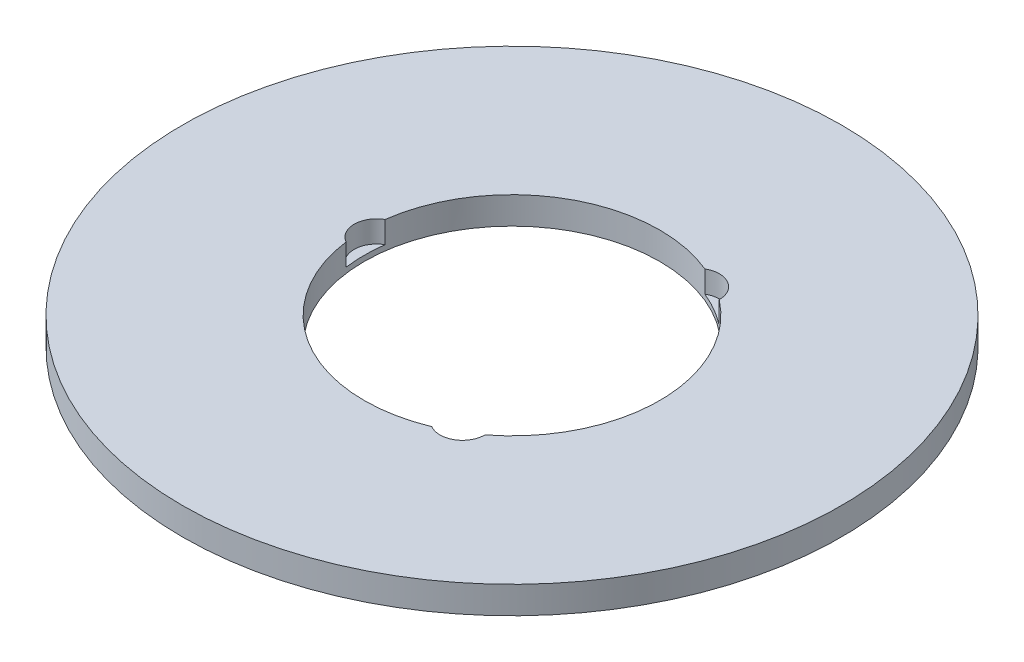
ISO-10303-21;
HEADER;
FILE_DESCRIPTION(('STEP AP214'),'2;1');
FILE_NAME('part.step','',(''),(''),'','','');
FILE_SCHEMA(('AUTOMOTIVE_DESIGN { 1 0 10303 214 1 1 1 1 }'));
ENDSEC;
DATA;
#1=APPLICATION_CONTEXT('core data for automotive mechanical design processes');
#2=APPLICATION_PROTOCOL_DEFINITION('international standard','automotive_design',2000,#1);
#3=PRODUCT_CONTEXT('',#1,'mechanical');
#4=PRODUCT('Part','Part','',(#3));
#5=PRODUCT_RELATED_PRODUCT_CATEGORY('part','',(#4));
#6=PRODUCT_DEFINITION_FORMATION('','',#4);
#7=PRODUCT_DEFINITION_CONTEXT('part definition',#1,'design');
#8=PRODUCT_DEFINITION('design','',#6,#7);
#9=PRODUCT_DEFINITION_SHAPE('','',#8);
#10=(LENGTH_UNIT() NAMED_UNIT(*) SI_UNIT(.MILLI.,.METRE.));
#11=(NAMED_UNIT(*) PLANE_ANGLE_UNIT() SI_UNIT($,.RADIAN.));
#12=(NAMED_UNIT(*) SI_UNIT($,.STERADIAN.) SOLID_ANGLE_UNIT());
#13=UNCERTAINTY_MEASURE_WITH_UNIT(LENGTH_MEASURE(1.E-05),#10,'distance_accuracy_value','');
#14=(GEOMETRIC_REPRESENTATION_CONTEXT(3) GLOBAL_UNCERTAINTY_ASSIGNED_CONTEXT((#13)) GLOBAL_UNIT_ASSIGNED_CONTEXT((#10,
#11,#12)) REPRESENTATION_CONTEXT('',''));
#15=CARTESIAN_POINT('',(0.,0.,0.));
#16=DIRECTION('',(0.,0.,1.));
#17=DIRECTION('',(1.,0.,0.));
#18=AXIS2_PLACEMENT_3D('',#15,#16,#17);
#19=CARTESIAN_POINT('',(0.,6.,0.));
#20=DIRECTION('',(0.,-1.,0.));
#21=DIRECTION('',(0.,0.,-1.));
#22=AXIS2_PLACEMENT_3D('',#19,#20,#21);
#23=CYLINDRICAL_SURFACE('',#22,72.5);
#24=CARTESIAN_POINT('',(0.,6.,0.));
#25=DIRECTION('',(0.,1.,0.));
#26=DIRECTION('',(0.,0.,1.));
#27=AXIS2_PLACEMENT_3D('',#24,#25,#26);
#28=CIRCLE('',#27,72.5);
#29=CARTESIAN_POINT('',(0.,6.,72.5));
#30=VERTEX_POINT('',#29);
#31=EDGE_CURVE('E130',#30,#30,#28,.T.);
#32=ORIENTED_EDGE('',*,*,#31,.F.);
#33=EDGE_LOOP('',(#32));
#34=FACE_BOUND('',#33,.T.);
#35=CARTESIAN_POINT('',(0.,0.,0.));
#36=DIRECTION('',(0.,1.,0.));
#37=DIRECTION('',(0.,0.,1.));
#38=AXIS2_PLACEMENT_3D('',#35,#36,#37);
#39=CIRCLE('',#38,72.5);
#40=CARTESIAN_POINT('',(0.,0.,72.5));
#41=VERTEX_POINT('',#40);
#42=EDGE_CURVE('E117',#41,#41,#39,.T.);
#43=ORIENTED_EDGE('',*,*,#42,.T.);
#44=EDGE_LOOP('',(#43));
#45=FACE_BOUND('',#44,.T.);
#46=ADVANCED_FACE('F39',(#34,#45),#23,.T.);
#47=CARTESIAN_POINT('',(0.,6.,0.));
#48=DIRECTION('',(0.,1.,0.));
#49=DIRECTION('',(0.,0.,1.));
#50=AXIS2_PLACEMENT_3D('',#47,#48,#49);
#51=PLANE('',#50);
#52=CARTESIAN_POINT('',(14.897619886915,6.,25.803434555985));
#53=DIRECTION('',(0.,1.,0.));
#54=DIRECTION('',(0.866025403784436,0.,-0.500000000000004));
#55=AXIS2_PLACEMENT_3D('',#52,#53,#54);
#56=CIRCLE('',#55,4.92004012785687);
#57=CARTESIAN_POINT('',(12.399089554762,6.,30.0418471171963));
#58=VERTEX_POINT('',#57);
#59=CARTESIAN_POINT('',(19.8174580027195,6.,25.7588500968201));
#60=VERTEX_POINT('',#59);
#61=EDGE_CURVE('E148',#58,#60,#56,.T.);
#62=ORIENTED_EDGE('',*,*,#61,.F.);
#63=CARTESIAN_POINT('',(0.,6.,0.));
#64=DIRECTION('',(0.,1.,0.));
#65=DIRECTION('',(0.,0.,1.));
#66=AXIS2_PLACEMENT_3D('',#63,#64,#65);
#67=CIRCLE('',#66,32.5);
#68=CARTESIAN_POINT('',(-32.2165475574812,6.,4.28299702037613));
#69=VERTEX_POINT('',#68);
#70=EDGE_CURVE('E113',#69,#58,#67,.T.);
#71=ORIENTED_EDGE('',*,*,#70,.F.);
#72=CARTESIAN_POINT('',(-29.7952397738298,6.,0.));
#73=DIRECTION('',(0.,1.,0.));
#74=DIRECTION('',(0.,0.,1.));
#75=AXIS2_PLACEMENT_3D('',#72,#73,#74);
#76=CIRCLE('',#75,4.92004012785687);
#77=CARTESIAN_POINT('',(-32.2165475574812,6.,-4.28299702037613));
#78=VERTEX_POINT('',#77);
#79=EDGE_CURVE('E125',#78,#69,#76,.T.);
#80=ORIENTED_EDGE('',*,*,#79,.F.);
#81=CARTESIAN_POINT('',(12.3990895547615,6.,-30.0418471171964));
#82=VERTEX_POINT('',#81);
#83=EDGE_CURVE('E107',#82,#78,#67,.T.);
#84=ORIENTED_EDGE('',*,*,#83,.F.);
#85=CARTESIAN_POINT('',(14.8976198869147,6.,-25.8034345559852));
#86=DIRECTION('',(0.,1.,0.));
#87=DIRECTION('',(-0.866025403784443,0.,-0.499999999999992));
#88=AXIS2_PLACEMENT_3D('',#85,#86,#87);
#89=CIRCLE('',#88,4.92004012785687);
#90=CARTESIAN_POINT('',(19.8174580027192,6.,-25.7588500968204));
#91=VERTEX_POINT('',#90);
#92=EDGE_CURVE('E95',#91,#82,#89,.T.);
#93=ORIENTED_EDGE('',*,*,#92,.F.);
#94=EDGE_CURVE('E106',#60,#91,#67,.T.);
#95=ORIENTED_EDGE('',*,*,#94,.F.);
#96=EDGE_LOOP('',(#62,#71,#80,#84,#93,#95));
#97=FACE_BOUND('',#96,.T.);
#98=ORIENTED_EDGE('',*,*,#31,.T.);
#99=EDGE_LOOP('',(#98));
#100=FACE_BOUND('',#99,.T.);
#101=ADVANCED_FACE('F102',(#97,#100),#51,.T.);
#102=CARTESIAN_POINT('',(0.,0.,0.));
#103=DIRECTION('',(0.,1.,0.));
#104=DIRECTION('',(0.,0.,1.));
#105=AXIS2_PLACEMENT_3D('',#102,#103,#104);
#106=PLANE('',#105);
#107=CARTESIAN_POINT('',(0.,0.,0.));
#108=DIRECTION('',(0.,1.,0.));
#109=DIRECTION('',(0.,0.,1.));
#110=AXIS2_PLACEMENT_3D('',#107,#108,#109);
#111=CIRCLE('',#110,32.5);
#112=CARTESIAN_POINT('',(0.,0.,32.5));
#113=VERTEX_POINT('',#112);
#114=EDGE_CURVE('E118',#113,#113,#111,.T.);
#115=ORIENTED_EDGE('',*,*,#114,.T.);
#116=EDGE_LOOP('',(#115));
#117=FACE_BOUND('',#116,.T.);
#118=ORIENTED_EDGE('',*,*,#42,.F.);
#119=EDGE_LOOP('',(#118));
#120=FACE_BOUND('',#119,.T.);
#121=ADVANCED_FACE('F161',(#117,#120),#106,.F.);
#122=CARTESIAN_POINT('',(0.,6.,0.));
#123=DIRECTION('',(0.,-1.,0.));
#124=DIRECTION('',(0.,0.,-1.));
#125=AXIS2_PLACEMENT_3D('',#122,#123,#124);
#126=CYLINDRICAL_SURFACE('',#125,32.5);
#127=DIRECTION('',(0.,1.,0.));
#128=VECTOR('',#127,1.);
#129=CARTESIAN_POINT('',(12.399089554762,3.59776294319901,30.0418471171963));
#130=LINE('',#129,#128);
#131=CARTESIAN_POINT('',(12.399089554762,1.19552588639802,30.0418471171963));
#132=VERTEX_POINT('',#131);
#133=EDGE_CURVE('E11',#132,#58,#130,.T.);
#134=ORIENTED_EDGE('',*,*,#133,.F.);
#135=CARTESIAN_POINT('',(0.,1.19552588639802,0.));
#136=DIRECTION('',(0.,1.,0.));
#137=DIRECTION('',(0.,0.,1.));
#138=AXIS2_PLACEMENT_3D('',#135,#136,#137);
#139=CIRCLE('',#138,32.5);
#140=CARTESIAN_POINT('',(19.8174580027195,1.19552588639802,25.7588500968201));
#141=VERTEX_POINT('',#140);
#142=EDGE_CURVE('E100',#132,#141,#139,.T.);
#143=ORIENTED_EDGE('',*,*,#142,.T.);
#144=DIRECTION('',(0.,1.,0.));
#145=VECTOR('',#144,1.);
#146=CARTESIAN_POINT('',(19.8174580027195,3.59776294319901,25.7588500968201));
#147=LINE('',#146,#145);
#148=EDGE_CURVE('E46',#60,#141,#147,.F.);
#149=ORIENTED_EDGE('',*,*,#148,.F.);
#150=ORIENTED_EDGE('',*,*,#94,.T.);
#151=DIRECTION('',(0.,1.,0.));
#152=VECTOR('',#151,1.);
#153=CARTESIAN_POINT('',(19.8174580027192,3.59776294319901,-25.7588500968204));
#154=LINE('',#153,#152);
#155=CARTESIAN_POINT('',(19.8174580027192,1.19552588639802,-25.7588500968204));
#156=VERTEX_POINT('',#155);
#157=EDGE_CURVE('E90',#156,#91,#154,.T.);
#158=ORIENTED_EDGE('',*,*,#157,.F.);
#159=CARTESIAN_POINT('',(0.,1.19552588639802,0.));
#160=DIRECTION('',(0.,1.,0.));
#161=DIRECTION('',(0.,0.,1.));
#162=AXIS2_PLACEMENT_3D('',#159,#160,#161);
#163=CIRCLE('',#162,32.5);
#164=CARTESIAN_POINT('',(12.3990895547615,1.19552588639802,-30.0418471171964));
#165=VERTEX_POINT('',#164);
#166=EDGE_CURVE('E143',#156,#165,#163,.T.);
#167=ORIENTED_EDGE('',*,*,#166,.T.);
#168=DIRECTION('',(0.,1.,0.));
#169=VECTOR('',#168,1.);
#170=CARTESIAN_POINT('',(12.3990895547616,3.59776294319901,-30.0418471171964));
#171=LINE('',#170,#169);
#172=EDGE_CURVE('E98',#82,#165,#171,.F.);
#173=ORIENTED_EDGE('',*,*,#172,.F.);
#174=ORIENTED_EDGE('',*,*,#83,.T.);
#175=DIRECTION('',(0.,1.,0.));
#176=VECTOR('',#175,1.);
#177=CARTESIAN_POINT('',(-32.2165475574812,3.59776294319901,-4.28299702037612));
#178=LINE('',#177,#176);
#179=CARTESIAN_POINT('',(-32.2165475574812,1.19552588639802,-4.28299702037613));
#180=VERTEX_POINT('',#179);
#181=EDGE_CURVE('E137',#180,#78,#178,.T.);
#182=ORIENTED_EDGE('',*,*,#181,.F.);
#183=CARTESIAN_POINT('',(0.,1.19552588639802,0.));
#184=DIRECTION('',(0.,1.,0.));
#185=DIRECTION('',(0.,0.,1.));
#186=AXIS2_PLACEMENT_3D('',#183,#184,#185);
#187=CIRCLE('',#186,32.5);
#188=CARTESIAN_POINT('',(-32.2165475574812,1.19552588639802,4.28299702037613));
#189=VERTEX_POINT('',#188);
#190=EDGE_CURVE('E128',#180,#189,#187,.T.);
#191=ORIENTED_EDGE('',*,*,#190,.T.);
#192=DIRECTION('',(0.,1.,0.));
#193=VECTOR('',#192,1.);
#194=CARTESIAN_POINT('',(-32.2165475574812,3.59776294319901,4.28299702037612));
#195=LINE('',#194,#193);
#196=EDGE_CURVE('E134',#69,#189,#195,.F.);
#197=ORIENTED_EDGE('',*,*,#196,.F.);
#198=ORIENTED_EDGE('',*,*,#70,.T.);
#199=EDGE_LOOP('',(#134,#143,#149,#150,#158,#167,#173,#174,#182,#191,#197,#198));
#200=FACE_BOUND('',#199,.T.);
#201=ORIENTED_EDGE('',*,*,#114,.F.);
#202=EDGE_LOOP('',(#201));
#203=FACE_BOUND('',#202,.T.);
#204=ADVANCED_FACE('F115',(#200,#203),#126,.F.);
#205=CARTESIAN_POINT('',(-29.7952397738298,1.19552588639802,0.));
#206=DIRECTION('',(0.,1.,0.));
#207=DIRECTION('',(0.,0.,1.));
#208=AXIS2_PLACEMENT_3D('',#205,#206,#207);
#209=CYLINDRICAL_SURFACE('',#208,4.92004012785687);
#210=ORIENTED_EDGE('',*,*,#181,.T.);
#211=ORIENTED_EDGE('',*,*,#79,.T.);
#212=ORIENTED_EDGE('',*,*,#196,.T.);
#213=CARTESIAN_POINT('',(-29.7952397738298,1.19552588639802,0.));
#214=DIRECTION('',(0.,1.,0.));
#215=DIRECTION('',(0.,0.,1.));
#216=AXIS2_PLACEMENT_3D('',#213,#214,#215);
#217=CIRCLE('',#216,4.92004012785687);
#218=EDGE_CURVE('E127',#180,#189,#217,.T.);
#219=ORIENTED_EDGE('',*,*,#218,.F.);
#220=EDGE_LOOP('',(#210,#211,#212,#219));
#221=FACE_BOUND('',#220,.T.);
#222=ADVANCED_FACE('F175',(#221),#209,.F.);
#223=CARTESIAN_POINT('',(-29.7952397738298,1.19552588639802,0.));
#224=DIRECTION('',(0.,1.,0.));
#225=DIRECTION('',(0.,0.,1.));
#226=AXIS2_PLACEMENT_3D('',#223,#224,#225);
#227=PLANE('',#226);
#228=ORIENTED_EDGE('',*,*,#218,.T.);
#229=ORIENTED_EDGE('',*,*,#190,.F.);
#230=EDGE_LOOP('',(#228,#229));
#231=FACE_BOUND('',#230,.T.);
#232=ADVANCED_FACE('F176',(#231),#227,.T.);
#233=CARTESIAN_POINT('',(14.8976198869147,1.19552588639802,-25.8034345559852));
#234=DIRECTION('',(0.,1.,0.));
#235=DIRECTION('',(0.,0.,1.));
#236=AXIS2_PLACEMENT_3D('',#233,#234,#235);
#237=CYLINDRICAL_SURFACE('',#236,4.92004012785687);
#238=ORIENTED_EDGE('',*,*,#157,.T.);
#239=ORIENTED_EDGE('',*,*,#92,.T.);
#240=ORIENTED_EDGE('',*,*,#172,.T.);
#241=CARTESIAN_POINT('',(14.8976198869147,1.19552588639802,-25.8034345559852));
#242=DIRECTION('',(0.,1.,0.));
#243=DIRECTION('',(-0.866025403784443,0.,-0.499999999999992));
#244=AXIS2_PLACEMENT_3D('',#241,#242,#243);
#245=CIRCLE('',#244,4.92004012785687);
#246=EDGE_CURVE('E56',#156,#165,#245,.T.);
#247=ORIENTED_EDGE('',*,*,#246,.F.);
#248=EDGE_LOOP('',(#238,#239,#240,#247));
#249=FACE_BOUND('',#248,.T.);
#250=ADVANCED_FACE('F93',(#249),#237,.F.);
#251=CARTESIAN_POINT('',(14.8976198869147,1.19552588639802,-25.8034345559852));
#252=DIRECTION('',(0.,1.,0.));
#253=DIRECTION('',(-0.866025403784443,0.,-0.499999999999992));
#254=AXIS2_PLACEMENT_3D('',#251,#252,#253);
#255=PLANE('',#254);
#256=ORIENTED_EDGE('',*,*,#246,.T.);
#257=ORIENTED_EDGE('',*,*,#166,.F.);
#258=EDGE_LOOP('',(#256,#257));
#259=FACE_BOUND('',#258,.T.);
#260=ADVANCED_FACE('F153',(#259),#255,.T.);
#261=CARTESIAN_POINT('',(14.897619886915,1.19552588639802,25.803434555985));
#262=DIRECTION('',(0.,1.,0.));
#263=DIRECTION('',(0.,0.,1.));
#264=AXIS2_PLACEMENT_3D('',#261,#262,#263);
#265=CYLINDRICAL_SURFACE('',#264,4.92004012785687);
#266=ORIENTED_EDGE('',*,*,#133,.T.);
#267=ORIENTED_EDGE('',*,*,#61,.T.);
#268=ORIENTED_EDGE('',*,*,#148,.T.);
#269=CARTESIAN_POINT('',(14.897619886915,1.19552588639802,25.803434555985));
#270=DIRECTION('',(0.,1.,0.));
#271=DIRECTION('',(0.866025403784436,0.,-0.500000000000004));
#272=AXIS2_PLACEMENT_3D('',#269,#270,#271);
#273=CIRCLE('',#272,4.92004012785687);
#274=EDGE_CURVE('E55',#132,#141,#273,.T.);
#275=ORIENTED_EDGE('',*,*,#274,.F.);
#276=EDGE_LOOP('',(#266,#267,#268,#275));
#277=FACE_BOUND('',#276,.T.);
#278=ADVANCED_FACE('F144',(#277),#265,.F.);
#279=CARTESIAN_POINT('',(14.897619886915,1.19552588639802,25.803434555985));
#280=DIRECTION('',(0.,1.,0.));
#281=DIRECTION('',(0.866025403784436,0.,-0.500000000000004));
#282=AXIS2_PLACEMENT_3D('',#279,#280,#281);
#283=PLANE('',#282);
#284=ORIENTED_EDGE('',*,*,#274,.T.);
#285=ORIENTED_EDGE('',*,*,#142,.F.);
#286=EDGE_LOOP('',(#284,#285));
#287=FACE_BOUND('',#286,.T.);
#288=ADVANCED_FACE('F150',(#287),#283,.T.);
#289=CLOSED_SHELL('',(#46,#101,#121,#204,#222,#232,#250,#260,#278,#288));
#290=MANIFOLD_SOLID_BREP('B2',#289);
#291=ADVANCED_BREP_SHAPE_REPRESENTATION('',(#18,#290),#14);
#292=SHAPE_DEFINITION_REPRESENTATION(#9,#291);
ENDSEC;
END-ISO-10303-21;
